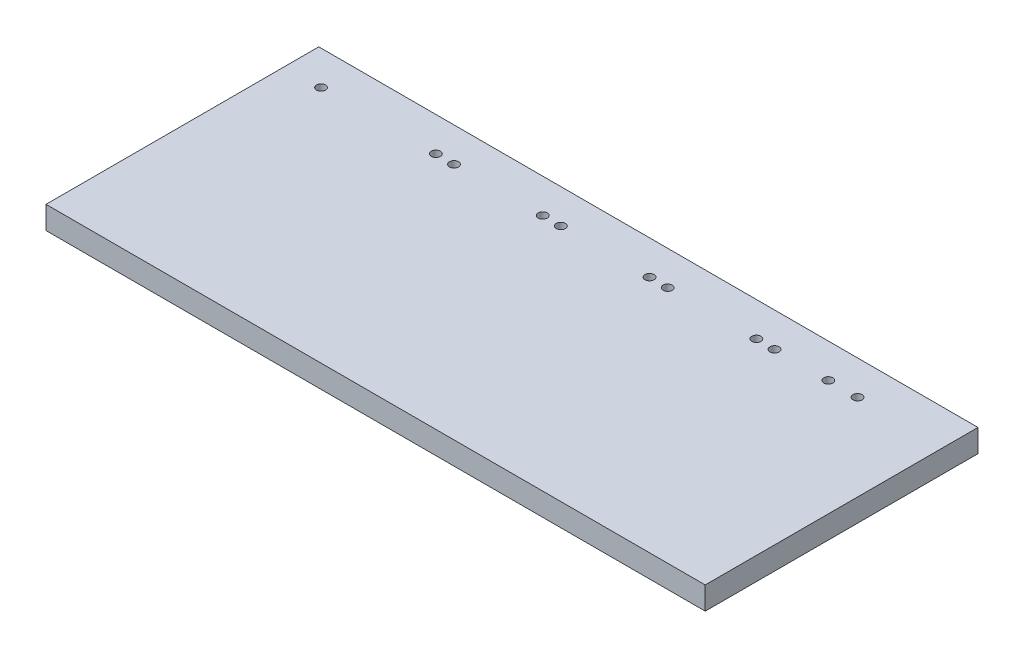
ISO-10303-21;
HEADER;
FILE_DESCRIPTION(('STEP AP214'),'2;1');
FILE_NAME('part.step','',(''),(''),'','','');
FILE_SCHEMA(('AUTOMOTIVE_DESIGN { 1 0 10303 214 1 1 1 1 }'));
ENDSEC;
DATA;
#1=APPLICATION_CONTEXT('core data for automotive mechanical design processes');
#2=APPLICATION_PROTOCOL_DEFINITION('international standard','automotive_design',2000,#1);
#3=PRODUCT_CONTEXT('',#1,'mechanical');
#4=PRODUCT('Part','Part','',(#3));
#5=PRODUCT_RELATED_PRODUCT_CATEGORY('part','',(#4));
#6=PRODUCT_DEFINITION_FORMATION('','',#4);
#7=PRODUCT_DEFINITION_CONTEXT('part definition',#1,'design');
#8=PRODUCT_DEFINITION('design','',#6,#7);
#9=PRODUCT_DEFINITION_SHAPE('','',#8);
#10=(LENGTH_UNIT() NAMED_UNIT(*) SI_UNIT(.MILLI.,.METRE.));
#11=(NAMED_UNIT(*) PLANE_ANGLE_UNIT() SI_UNIT($,.RADIAN.));
#12=(NAMED_UNIT(*) SI_UNIT($,.STERADIAN.) SOLID_ANGLE_UNIT());
#13=UNCERTAINTY_MEASURE_WITH_UNIT(LENGTH_MEASURE(1.E-05),#10,'distance_accuracy_value','');
#14=(GEOMETRIC_REPRESENTATION_CONTEXT(3) GLOBAL_UNCERTAINTY_ASSIGNED_CONTEXT((#13)) GLOBAL_UNIT_ASSIGNED_CONTEXT((#10,
#11,#12)) REPRESENTATION_CONTEXT('',''));
#15=CARTESIAN_POINT('',(0.,0.,0.));
#16=DIRECTION('',(0.,0.,1.));
#17=DIRECTION('',(1.,0.,0.));
#18=AXIS2_PLACEMENT_3D('',#15,#16,#17);
#19=CARTESIAN_POINT('',(0.,10.,0.));
#20=DIRECTION('',(1.,0.,0.));
#21=DIRECTION('',(0.,0.,-1.));
#22=AXIS2_PLACEMENT_3D('',#19,#20,#21);
#23=PLANE('',#22);
#24=DIRECTION('',(0.,0.,1.));
#25=VECTOR('',#24,1.);
#26=CARTESIAN_POINT('',(0.,0.,0.));
#27=LINE('',#26,#25);
#28=CARTESIAN_POINT('',(0.,0.,-120.));
#29=VERTEX_POINT('',#28);
#30=CARTESIAN_POINT('',(0.,0.,0.));
#31=VERTEX_POINT('',#30);
#32=EDGE_CURVE('E98',#29,#31,#27,.T.);
#33=ORIENTED_EDGE('',*,*,#32,.T.);
#34=DIRECTION('',(0.,-1.,0.));
#35=VECTOR('',#34,1.);
#36=CARTESIAN_POINT('',(0.,10.,0.));
#37=LINE('',#36,#35);
#38=CARTESIAN_POINT('',(0.,10.,0.));
#39=VERTEX_POINT('',#38);
#40=EDGE_CURVE('E11',#39,#31,#37,.T.);
#41=ORIENTED_EDGE('',*,*,#40,.F.);
#42=DIRECTION('',(0.,0.,1.));
#43=VECTOR('',#42,1.);
#44=CARTESIAN_POINT('',(0.,10.,0.));
#45=LINE('',#44,#43);
#46=CARTESIAN_POINT('',(0.,10.,-120.));
#47=VERTEX_POINT('',#46);
#48=EDGE_CURVE('E86',#47,#39,#45,.T.);
#49=ORIENTED_EDGE('',*,*,#48,.F.);
#50=DIRECTION('',(0.,-1.,0.));
#51=VECTOR('',#50,1.);
#52=CARTESIAN_POINT('',(0.,10.,-120.));
#53=LINE('',#52,#51);
#54=EDGE_CURVE('E94',#47,#29,#53,.T.);
#55=ORIENTED_EDGE('',*,*,#54,.T.);
#56=EDGE_LOOP('',(#33,#41,#49,#55));
#57=FACE_BOUND('',#56,.T.);
#58=ADVANCED_FACE('F35',(#57),#23,.F.);
#59=CARTESIAN_POINT('',(0.,10.,0.));
#60=DIRECTION('',(0.,0.,-1.));
#61=DIRECTION('',(-1.,0.,0.));
#62=AXIS2_PLACEMENT_3D('',#59,#60,#61);
#63=PLANE('',#62);
#64=DIRECTION('',(1.,0.,0.));
#65=VECTOR('',#64,1.);
#66=CARTESIAN_POINT('',(0.,0.,0.));
#67=LINE('',#66,#65);
#68=CARTESIAN_POINT('',(290.,0.,0.));
#69=VERTEX_POINT('',#68);
#70=EDGE_CURVE('E90',#31,#69,#67,.T.);
#71=ORIENTED_EDGE('',*,*,#70,.T.);
#72=DIRECTION('',(0.,-1.,0.));
#73=VECTOR('',#72,1.);
#74=CARTESIAN_POINT('',(290.,10.,0.));
#75=LINE('',#74,#73);
#76=CARTESIAN_POINT('',(290.,10.,0.));
#77=VERTEX_POINT('',#76);
#78=EDGE_CURVE('E43',#77,#69,#75,.T.);
#79=ORIENTED_EDGE('',*,*,#78,.F.);
#80=DIRECTION('',(1.,0.,0.));
#81=VECTOR('',#80,1.);
#82=CARTESIAN_POINT('',(0.,10.,0.));
#83=LINE('',#82,#81);
#84=EDGE_CURVE('E81',#39,#77,#83,.T.);
#85=ORIENTED_EDGE('',*,*,#84,.F.);
#86=ORIENTED_EDGE('',*,*,#40,.T.);
#87=EDGE_LOOP('',(#71,#79,#85,#86));
#88=FACE_BOUND('',#87,.T.);
#89=ADVANCED_FACE('F89',(#88),#63,.F.);
#90=CARTESIAN_POINT('',(290.,10.,0.));
#91=DIRECTION('',(-1.,0.,0.));
#92=DIRECTION('',(0.,0.,1.));
#93=AXIS2_PLACEMENT_3D('',#90,#91,#92);
#94=PLANE('',#93);
#95=DIRECTION('',(0.,0.,-1.));
#96=VECTOR('',#95,1.);
#97=CARTESIAN_POINT('',(290.,0.,0.));
#98=LINE('',#97,#96);
#99=CARTESIAN_POINT('',(290.,0.,-120.));
#100=VERTEX_POINT('',#99);
#101=EDGE_CURVE('E68',#69,#100,#98,.T.);
#102=ORIENTED_EDGE('',*,*,#101,.T.);
#103=DIRECTION('',(0.,-1.,0.));
#104=VECTOR('',#103,1.);
#105=CARTESIAN_POINT('',(290.,10.,-120.));
#106=LINE('',#105,#104);
#107=CARTESIAN_POINT('',(290.,10.,-120.));
#108=VERTEX_POINT('',#107);
#109=EDGE_CURVE('E91',#108,#100,#106,.T.);
#110=ORIENTED_EDGE('',*,*,#109,.F.);
#111=DIRECTION('',(0.,0.,-1.));
#112=VECTOR('',#111,1.);
#113=CARTESIAN_POINT('',(290.,10.,0.));
#114=LINE('',#113,#112);
#115=EDGE_CURVE('E84',#77,#108,#114,.T.);
#116=ORIENTED_EDGE('',*,*,#115,.F.);
#117=ORIENTED_EDGE('',*,*,#78,.T.);
#118=EDGE_LOOP('',(#102,#110,#116,#117));
#119=FACE_BOUND('',#118,.T.);
#120=ADVANCED_FACE('F92',(#119),#94,.F.);
#121=CARTESIAN_POINT('',(0.,10.,-120.));
#122=DIRECTION('',(0.,0.,1.));
#123=DIRECTION('',(1.,0.,0.));
#124=AXIS2_PLACEMENT_3D('',#121,#122,#123);
#125=PLANE('',#124);
#126=DIRECTION('',(-1.,0.,0.));
#127=VECTOR('',#126,1.);
#128=CARTESIAN_POINT('',(0.,0.,-120.));
#129=LINE('',#128,#127);
#130=EDGE_CURVE('E74',#100,#29,#129,.T.);
#131=ORIENTED_EDGE('',*,*,#130,.T.);
#132=ORIENTED_EDGE('',*,*,#54,.F.);
#133=DIRECTION('',(-1.,0.,0.));
#134=VECTOR('',#133,1.);
#135=CARTESIAN_POINT('',(0.,10.,-120.));
#136=LINE('',#135,#134);
#137=EDGE_CURVE('E51',#108,#47,#136,.T.);
#138=ORIENTED_EDGE('',*,*,#137,.F.);
#139=ORIENTED_EDGE('',*,*,#109,.T.);
#140=EDGE_LOOP('',(#131,#132,#138,#139));
#141=FACE_BOUND('',#140,.T.);
#142=ADVANCED_FACE('F106',(#141),#125,.F.);
#143=CARTESIAN_POINT('',(0.,10.,0.));
#144=DIRECTION('',(0.,-1.,0.));
#145=DIRECTION('',(0.,0.,-1.));
#146=AXIS2_PLACEMENT_3D('',#143,#144,#145);
#147=PLANE('',#146);
#148=CARTESIAN_POINT('',(239.160986850104,10.,-105.));
#149=DIRECTION('',(0.,1.,0.));
#150=DIRECTION('',(0.,0.,1.));
#151=AXIS2_PLACEMENT_3D('',#148,#149,#150);
#152=CIRCLE('',#151,2.);
#153=CARTESIAN_POINT('',(239.160986850104,10.,-103.));
#154=VERTEX_POINT('',#153);
#155=EDGE_CURVE('E172',#154,#154,#152,.T.);
#156=ORIENTED_EDGE('',*,*,#155,.F.);
#157=EDGE_LOOP('',(#156));
#158=FACE_BOUND('',#157,.T.);
#159=CARTESIAN_POINT('',(215.5,10.,-105.));
#160=DIRECTION('',(0.,1.,0.));
#161=DIRECTION('',(0.,0.,1.));
#162=AXIS2_PLACEMENT_3D('',#159,#160,#161);
#163=CIRCLE('',#162,2.);
#164=CARTESIAN_POINT('',(215.5,10.,-103.));
#165=VERTEX_POINT('',#164);
#166=EDGE_CURVE('E166',#165,#165,#163,.T.);
#167=ORIENTED_EDGE('',*,*,#166,.F.);
#168=EDGE_LOOP('',(#167));
#169=FACE_BOUND('',#168,.T.);
#170=CARTESIAN_POINT('',(207.5,10.,-105.));
#171=DIRECTION('',(0.,1.,0.));
#172=DIRECTION('',(0.,0.,1.));
#173=AXIS2_PLACEMENT_3D('',#170,#171,#172);
#174=CIRCLE('',#173,2.);
#175=CARTESIAN_POINT('',(207.5,10.,-103.));
#176=VERTEX_POINT('',#175);
#177=EDGE_CURVE('E160',#176,#176,#174,.T.);
#178=ORIENTED_EDGE('',*,*,#177,.F.);
#179=EDGE_LOOP('',(#178));
#180=FACE_BOUND('',#179,.T.);
#181=CARTESIAN_POINT('',(168.5,10.,-105.));
#182=DIRECTION('',(0.,1.,0.));
#183=DIRECTION('',(0.,0.,1.));
#184=AXIS2_PLACEMENT_3D('',#181,#182,#183);
#185=CIRCLE('',#184,2.);
#186=CARTESIAN_POINT('',(168.5,10.,-103.));
#187=VERTEX_POINT('',#186);
#188=EDGE_CURVE('E154',#187,#187,#185,.T.);
#189=ORIENTED_EDGE('',*,*,#188,.F.);
#190=EDGE_LOOP('',(#189));
#191=FACE_BOUND('',#190,.T.);
#192=CARTESIAN_POINT('',(160.5,10.,-105.));
#193=DIRECTION('',(0.,1.,0.));
#194=DIRECTION('',(0.,0.,1.));
#195=AXIS2_PLACEMENT_3D('',#192,#193,#194);
#196=CIRCLE('',#195,2.);
#197=CARTESIAN_POINT('',(160.5,10.,-103.));
#198=VERTEX_POINT('',#197);
#199=EDGE_CURVE('E148',#198,#198,#196,.T.);
#200=ORIENTED_EDGE('',*,*,#199,.F.);
#201=EDGE_LOOP('',(#200));
#202=FACE_BOUND('',#201,.T.);
#203=CARTESIAN_POINT('',(121.5,10.,-105.));
#204=DIRECTION('',(0.,1.,0.));
#205=DIRECTION('',(0.,0.,1.));
#206=AXIS2_PLACEMENT_3D('',#203,#204,#205);
#207=CIRCLE('',#206,2.);
#208=CARTESIAN_POINT('',(121.5,10.,-103.));
#209=VERTEX_POINT('',#208);
#210=EDGE_CURVE('E142',#209,#209,#207,.T.);
#211=ORIENTED_EDGE('',*,*,#210,.F.);
#212=EDGE_LOOP('',(#211));
#213=FACE_BOUND('',#212,.T.);
#214=CARTESIAN_POINT('',(113.5,10.,-105.));
#215=DIRECTION('',(0.,1.,0.));
#216=DIRECTION('',(0.,0.,1.));
#217=AXIS2_PLACEMENT_3D('',#214,#215,#216);
#218=CIRCLE('',#217,2.);
#219=CARTESIAN_POINT('',(113.5,10.,-103.));
#220=VERTEX_POINT('',#219);
#221=EDGE_CURVE('E136',#220,#220,#218,.T.);
#222=ORIENTED_EDGE('',*,*,#221,.F.);
#223=EDGE_LOOP('',(#222));
#224=FACE_BOUND('',#223,.T.);
#225=CARTESIAN_POINT('',(74.5,10.,-105.));
#226=DIRECTION('',(0.,1.,0.));
#227=DIRECTION('',(0.,0.,1.));
#228=AXIS2_PLACEMENT_3D('',#225,#226,#227);
#229=CIRCLE('',#228,2.);
#230=CARTESIAN_POINT('',(74.5,10.,-103.));
#231=VERTEX_POINT('',#230);
#232=EDGE_CURVE('E130',#231,#231,#229,.T.);
#233=ORIENTED_EDGE('',*,*,#232,.F.);
#234=EDGE_LOOP('',(#233));
#235=FACE_BOUND('',#234,.T.);
#236=CARTESIAN_POINT('',(66.5,10.,-105.));
#237=DIRECTION('',(0.,1.,0.));
#238=DIRECTION('',(0.,0.,1.));
#239=AXIS2_PLACEMENT_3D('',#236,#237,#238);
#240=CIRCLE('',#239,2.);
#241=CARTESIAN_POINT('',(66.5,10.,-103.));
#242=VERTEX_POINT('',#241);
#243=EDGE_CURVE('E124',#242,#242,#240,.T.);
#244=ORIENTED_EDGE('',*,*,#243,.F.);
#245=EDGE_LOOP('',(#244));
#246=FACE_BOUND('',#245,.T.);
#247=CARTESIAN_POINT('',(252.,10.,-105.));
#248=DIRECTION('',(0.,1.,0.));
#249=DIRECTION('',(0.,0.,1.));
#250=AXIS2_PLACEMENT_3D('',#247,#248,#249);
#251=CIRCLE('',#250,2.);
#252=CARTESIAN_POINT('',(252.,10.,-103.));
#253=VERTEX_POINT('',#252);
#254=EDGE_CURVE('E118',#253,#253,#251,.T.);
#255=ORIENTED_EDGE('',*,*,#254,.F.);
#256=EDGE_LOOP('',(#255));
#257=FACE_BOUND('',#256,.T.);
#258=CARTESIAN_POINT('',(16.,10.,-105.));
#259=DIRECTION('',(0.,1.,0.));
#260=DIRECTION('',(0.,0.,1.));
#261=AXIS2_PLACEMENT_3D('',#258,#259,#260);
#262=CIRCLE('',#261,2.);
#263=CARTESIAN_POINT('',(16.,10.,-103.));
#264=VERTEX_POINT('',#263);
#265=EDGE_CURVE('E112',#264,#264,#262,.T.);
#266=ORIENTED_EDGE('',*,*,#265,.F.);
#267=EDGE_LOOP('',(#266));
#268=FACE_BOUND('',#267,.T.);
#269=ORIENTED_EDGE('',*,*,#48,.T.);
#270=ORIENTED_EDGE('',*,*,#84,.T.);
#271=ORIENTED_EDGE('',*,*,#115,.T.);
#272=ORIENTED_EDGE('',*,*,#137,.T.);
#273=EDGE_LOOP('',(#269,#270,#271,#272));
#274=FACE_BOUND('',#273,.T.);
#275=ADVANCED_FACE('F82',(#158,#169,#180,#191,#202,#213,#224,#235,#246,#257,#268,#274),#147,.F.);
#276=CARTESIAN_POINT('',(0.,0.,0.));
#277=DIRECTION('',(0.,-1.,0.));
#278=DIRECTION('',(0.,0.,-1.));
#279=AXIS2_PLACEMENT_3D('',#276,#277,#278);
#280=PLANE('',#279);
#281=CARTESIAN_POINT('',(239.160986850104,0.,-105.));
#282=DIRECTION('',(0.,1.,0.));
#283=DIRECTION('',(0.,0.,1.));
#284=AXIS2_PLACEMENT_3D('',#281,#282,#283);
#285=CIRCLE('',#284,2.);
#286=CARTESIAN_POINT('',(239.160986850104,0.,-103.));
#287=VERTEX_POINT('',#286);
#288=EDGE_CURVE('E169',#287,#287,#285,.T.);
#289=ORIENTED_EDGE('',*,*,#288,.T.);
#290=EDGE_LOOP('',(#289));
#291=FACE_BOUND('',#290,.T.);
#292=CARTESIAN_POINT('',(215.5,0.,-105.));
#293=DIRECTION('',(0.,1.,0.));
#294=DIRECTION('',(0.,0.,1.));
#295=AXIS2_PLACEMENT_3D('',#292,#293,#294);
#296=CIRCLE('',#295,2.);
#297=CARTESIAN_POINT('',(215.5,0.,-103.));
#298=VERTEX_POINT('',#297);
#299=EDGE_CURVE('E163',#298,#298,#296,.T.);
#300=ORIENTED_EDGE('',*,*,#299,.T.);
#301=EDGE_LOOP('',(#300));
#302=FACE_BOUND('',#301,.T.);
#303=CARTESIAN_POINT('',(207.5,0.,-105.));
#304=DIRECTION('',(0.,1.,0.));
#305=DIRECTION('',(0.,0.,1.));
#306=AXIS2_PLACEMENT_3D('',#303,#304,#305);
#307=CIRCLE('',#306,2.);
#308=CARTESIAN_POINT('',(207.5,0.,-103.));
#309=VERTEX_POINT('',#308);
#310=EDGE_CURVE('E157',#309,#309,#307,.T.);
#311=ORIENTED_EDGE('',*,*,#310,.T.);
#312=EDGE_LOOP('',(#311));
#313=FACE_BOUND('',#312,.T.);
#314=CARTESIAN_POINT('',(168.5,0.,-105.));
#315=DIRECTION('',(0.,1.,0.));
#316=DIRECTION('',(0.,0.,1.));
#317=AXIS2_PLACEMENT_3D('',#314,#315,#316);
#318=CIRCLE('',#317,2.);
#319=CARTESIAN_POINT('',(168.5,0.,-103.));
#320=VERTEX_POINT('',#319);
#321=EDGE_CURVE('E151',#320,#320,#318,.T.);
#322=ORIENTED_EDGE('',*,*,#321,.T.);
#323=EDGE_LOOP('',(#322));
#324=FACE_BOUND('',#323,.T.);
#325=CARTESIAN_POINT('',(160.5,0.,-105.));
#326=DIRECTION('',(0.,1.,0.));
#327=DIRECTION('',(0.,0.,1.));
#328=AXIS2_PLACEMENT_3D('',#325,#326,#327);
#329=CIRCLE('',#328,2.);
#330=CARTESIAN_POINT('',(160.5,0.,-103.));
#331=VERTEX_POINT('',#330);
#332=EDGE_CURVE('E145',#331,#331,#329,.T.);
#333=ORIENTED_EDGE('',*,*,#332,.T.);
#334=EDGE_LOOP('',(#333));
#335=FACE_BOUND('',#334,.T.);
#336=CARTESIAN_POINT('',(121.5,0.,-105.));
#337=DIRECTION('',(0.,1.,0.));
#338=DIRECTION('',(0.,0.,1.));
#339=AXIS2_PLACEMENT_3D('',#336,#337,#338);
#340=CIRCLE('',#339,2.);
#341=CARTESIAN_POINT('',(121.5,0.,-103.));
#342=VERTEX_POINT('',#341);
#343=EDGE_CURVE('E139',#342,#342,#340,.T.);
#344=ORIENTED_EDGE('',*,*,#343,.T.);
#345=EDGE_LOOP('',(#344));
#346=FACE_BOUND('',#345,.T.);
#347=CARTESIAN_POINT('',(113.5,0.,-105.));
#348=DIRECTION('',(0.,1.,0.));
#349=DIRECTION('',(0.,0.,1.));
#350=AXIS2_PLACEMENT_3D('',#347,#348,#349);
#351=CIRCLE('',#350,2.);
#352=CARTESIAN_POINT('',(113.5,0.,-103.));
#353=VERTEX_POINT('',#352);
#354=EDGE_CURVE('E133',#353,#353,#351,.T.);
#355=ORIENTED_EDGE('',*,*,#354,.T.);
#356=EDGE_LOOP('',(#355));
#357=FACE_BOUND('',#356,.T.);
#358=CARTESIAN_POINT('',(74.5,0.,-105.));
#359=DIRECTION('',(0.,1.,0.));
#360=DIRECTION('',(0.,0.,1.));
#361=AXIS2_PLACEMENT_3D('',#358,#359,#360);
#362=CIRCLE('',#361,2.);
#363=CARTESIAN_POINT('',(74.5,0.,-103.));
#364=VERTEX_POINT('',#363);
#365=EDGE_CURVE('E127',#364,#364,#362,.T.);
#366=ORIENTED_EDGE('',*,*,#365,.T.);
#367=EDGE_LOOP('',(#366));
#368=FACE_BOUND('',#367,.T.);
#369=CARTESIAN_POINT('',(66.5,0.,-105.));
#370=DIRECTION('',(0.,1.,0.));
#371=DIRECTION('',(0.,0.,1.));
#372=AXIS2_PLACEMENT_3D('',#369,#370,#371);
#373=CIRCLE('',#372,2.);
#374=CARTESIAN_POINT('',(66.5,0.,-103.));
#375=VERTEX_POINT('',#374);
#376=EDGE_CURVE('E121',#375,#375,#373,.T.);
#377=ORIENTED_EDGE('',*,*,#376,.T.);
#378=EDGE_LOOP('',(#377));
#379=FACE_BOUND('',#378,.T.);
#380=CARTESIAN_POINT('',(252.,0.,-105.));
#381=DIRECTION('',(0.,1.,0.));
#382=DIRECTION('',(0.,0.,1.));
#383=AXIS2_PLACEMENT_3D('',#380,#381,#382);
#384=CIRCLE('',#383,2.);
#385=CARTESIAN_POINT('',(252.,0.,-103.));
#386=VERTEX_POINT('',#385);
#387=EDGE_CURVE('E115',#386,#386,#384,.T.);
#388=ORIENTED_EDGE('',*,*,#387,.T.);
#389=EDGE_LOOP('',(#388));
#390=FACE_BOUND('',#389,.T.);
#391=CARTESIAN_POINT('',(16.,0.,-105.));
#392=DIRECTION('',(0.,1.,0.));
#393=DIRECTION('',(0.,0.,1.));
#394=AXIS2_PLACEMENT_3D('',#391,#392,#393);
#395=CIRCLE('',#394,2.);
#396=CARTESIAN_POINT('',(16.,0.,-103.));
#397=VERTEX_POINT('',#396);
#398=EDGE_CURVE('E101',#397,#397,#395,.T.);
#399=ORIENTED_EDGE('',*,*,#398,.T.);
#400=EDGE_LOOP('',(#399));
#401=FACE_BOUND('',#400,.T.);
#402=ORIENTED_EDGE('',*,*,#32,.F.);
#403=ORIENTED_EDGE('',*,*,#130,.F.);
#404=ORIENTED_EDGE('',*,*,#101,.F.);
#405=ORIENTED_EDGE('',*,*,#70,.F.);
#406=EDGE_LOOP('',(#402,#403,#404,#405));
#407=FACE_BOUND('',#406,.T.);
#408=ADVANCED_FACE('F109',(#291,#302,#313,#324,#335,#346,#357,#368,#379,#390,#401,#407),#280,.T.);
#409=CARTESIAN_POINT('',(16.,0.,-105.));
#410=DIRECTION('',(0.,1.,0.));
#411=DIRECTION('',(0.,0.,1.));
#412=AXIS2_PLACEMENT_3D('',#409,#410,#411);
#413=CYLINDRICAL_SURFACE('',#412,2.);
#414=ORIENTED_EDGE('',*,*,#398,.F.);
#415=EDGE_LOOP('',(#414));
#416=FACE_BOUND('',#415,.T.);
#417=ORIENTED_EDGE('',*,*,#265,.T.);
#418=EDGE_LOOP('',(#417));
#419=FACE_BOUND('',#418,.T.);
#420=ADVANCED_FACE('F210',(#416,#419),#413,.F.);
#421=CARTESIAN_POINT('',(252.,0.,-105.));
#422=DIRECTION('',(0.,1.,0.));
#423=DIRECTION('',(0.,0.,1.));
#424=AXIS2_PLACEMENT_3D('',#421,#422,#423);
#425=CYLINDRICAL_SURFACE('',#424,2.);
#426=ORIENTED_EDGE('',*,*,#387,.F.);
#427=EDGE_LOOP('',(#426));
#428=FACE_BOUND('',#427,.T.);
#429=ORIENTED_EDGE('',*,*,#254,.T.);
#430=EDGE_LOOP('',(#429));
#431=FACE_BOUND('',#430,.T.);
#432=ADVANCED_FACE('F212',(#428,#431),#425,.F.);
#433=CARTESIAN_POINT('',(66.5,0.,-105.));
#434=DIRECTION('',(0.,1.,0.));
#435=DIRECTION('',(0.,0.,1.));
#436=AXIS2_PLACEMENT_3D('',#433,#434,#435);
#437=CYLINDRICAL_SURFACE('',#436,2.);
#438=ORIENTED_EDGE('',*,*,#376,.F.);
#439=EDGE_LOOP('',(#438));
#440=FACE_BOUND('',#439,.T.);
#441=ORIENTED_EDGE('',*,*,#243,.T.);
#442=EDGE_LOOP('',(#441));
#443=FACE_BOUND('',#442,.T.);
#444=ADVANCED_FACE('F219',(#440,#443),#437,.F.);
#445=CARTESIAN_POINT('',(74.5,0.,-105.));
#446=DIRECTION('',(0.,1.,0.));
#447=DIRECTION('',(0.,0.,1.));
#448=AXIS2_PLACEMENT_3D('',#445,#446,#447);
#449=CYLINDRICAL_SURFACE('',#448,2.);
#450=ORIENTED_EDGE('',*,*,#365,.F.);
#451=EDGE_LOOP('',(#450));
#452=FACE_BOUND('',#451,.T.);
#453=ORIENTED_EDGE('',*,*,#232,.T.);
#454=EDGE_LOOP('',(#453));
#455=FACE_BOUND('',#454,.T.);
#456=ADVANCED_FACE('F267',(#452,#455),#449,.F.);
#457=CARTESIAN_POINT('',(113.5,0.,-105.));
#458=DIRECTION('',(0.,1.,0.));
#459=DIRECTION('',(0.,0.,1.));
#460=AXIS2_PLACEMENT_3D('',#457,#458,#459);
#461=CYLINDRICAL_SURFACE('',#460,2.);
#462=ORIENTED_EDGE('',*,*,#354,.F.);
#463=EDGE_LOOP('',(#462));
#464=FACE_BOUND('',#463,.T.);
#465=ORIENTED_EDGE('',*,*,#221,.T.);
#466=EDGE_LOOP('',(#465));
#467=FACE_BOUND('',#466,.T.);
#468=ADVANCED_FACE('F277',(#464,#467),#461,.F.);
#469=CARTESIAN_POINT('',(121.5,0.,-105.));
#470=DIRECTION('',(0.,1.,0.));
#471=DIRECTION('',(0.,0.,1.));
#472=AXIS2_PLACEMENT_3D('',#469,#470,#471);
#473=CYLINDRICAL_SURFACE('',#472,2.);
#474=ORIENTED_EDGE('',*,*,#343,.F.);
#475=EDGE_LOOP('',(#474));
#476=FACE_BOUND('',#475,.T.);
#477=ORIENTED_EDGE('',*,*,#210,.T.);
#478=EDGE_LOOP('',(#477));
#479=FACE_BOUND('',#478,.T.);
#480=ADVANCED_FACE('F287',(#476,#479),#473,.F.);
#481=CARTESIAN_POINT('',(160.5,0.,-105.));
#482=DIRECTION('',(0.,1.,0.));
#483=DIRECTION('',(0.,0.,1.));
#484=AXIS2_PLACEMENT_3D('',#481,#482,#483);
#485=CYLINDRICAL_SURFACE('',#484,2.);
#486=ORIENTED_EDGE('',*,*,#332,.F.);
#487=EDGE_LOOP('',(#486));
#488=FACE_BOUND('',#487,.T.);
#489=ORIENTED_EDGE('',*,*,#199,.T.);
#490=EDGE_LOOP('',(#489));
#491=FACE_BOUND('',#490,.T.);
#492=ADVANCED_FACE('F297',(#488,#491),#485,.F.);
#493=CARTESIAN_POINT('',(168.5,0.,-105.));
#494=DIRECTION('',(0.,1.,0.));
#495=DIRECTION('',(0.,0.,1.));
#496=AXIS2_PLACEMENT_3D('',#493,#494,#495);
#497=CYLINDRICAL_SURFACE('',#496,2.);
#498=ORIENTED_EDGE('',*,*,#321,.F.);
#499=EDGE_LOOP('',(#498));
#500=FACE_BOUND('',#499,.T.);
#501=ORIENTED_EDGE('',*,*,#188,.T.);
#502=EDGE_LOOP('',(#501));
#503=FACE_BOUND('',#502,.T.);
#504=ADVANCED_FACE('F307',(#500,#503),#497,.F.);
#505=CARTESIAN_POINT('',(207.5,0.,-105.));
#506=DIRECTION('',(0.,1.,0.));
#507=DIRECTION('',(0.,0.,1.));
#508=AXIS2_PLACEMENT_3D('',#505,#506,#507);
#509=CYLINDRICAL_SURFACE('',#508,2.);
#510=ORIENTED_EDGE('',*,*,#310,.F.);
#511=EDGE_LOOP('',(#510));
#512=FACE_BOUND('',#511,.T.);
#513=ORIENTED_EDGE('',*,*,#177,.T.);
#514=EDGE_LOOP('',(#513));
#515=FACE_BOUND('',#514,.T.);
#516=ADVANCED_FACE('F317',(#512,#515),#509,.F.);
#517=CARTESIAN_POINT('',(215.5,0.,-105.));
#518=DIRECTION('',(0.,1.,0.));
#519=DIRECTION('',(0.,0.,1.));
#520=AXIS2_PLACEMENT_3D('',#517,#518,#519);
#521=CYLINDRICAL_SURFACE('',#520,2.);
#522=ORIENTED_EDGE('',*,*,#299,.F.);
#523=EDGE_LOOP('',(#522));
#524=FACE_BOUND('',#523,.T.);
#525=ORIENTED_EDGE('',*,*,#166,.T.);
#526=EDGE_LOOP('',(#525));
#527=FACE_BOUND('',#526,.T.);
#528=ADVANCED_FACE('F183',(#524,#527),#521,.F.);
#529=CARTESIAN_POINT('',(239.160986850104,0.,-105.));
#530=DIRECTION('',(0.,1.,0.));
#531=DIRECTION('',(0.,0.,1.));
#532=AXIS2_PLACEMENT_3D('',#529,#530,#531);
#533=CYLINDRICAL_SURFACE('',#532,2.);
#534=ORIENTED_EDGE('',*,*,#288,.F.);
#535=EDGE_LOOP('',(#534));
#536=FACE_BOUND('',#535,.T.);
#537=ORIENTED_EDGE('',*,*,#155,.T.);
#538=EDGE_LOOP('',(#537));
#539=FACE_BOUND('',#538,.T.);
#540=ADVANCED_FACE('F180',(#536,#539),#533,.F.);
#541=CLOSED_SHELL('',(#58,#89,#120,#142,#275,#408,#420,#432,#444,#456,#468,#480,#492,#504,#516,
#528,#540));
#542=MANIFOLD_SOLID_BREP('B2',#541);
#543=ADVANCED_BREP_SHAPE_REPRESENTATION('',(#18,#542),#14);
#544=SHAPE_DEFINITION_REPRESENTATION(#9,#543);
ENDSEC;
END-ISO-10303-21;
